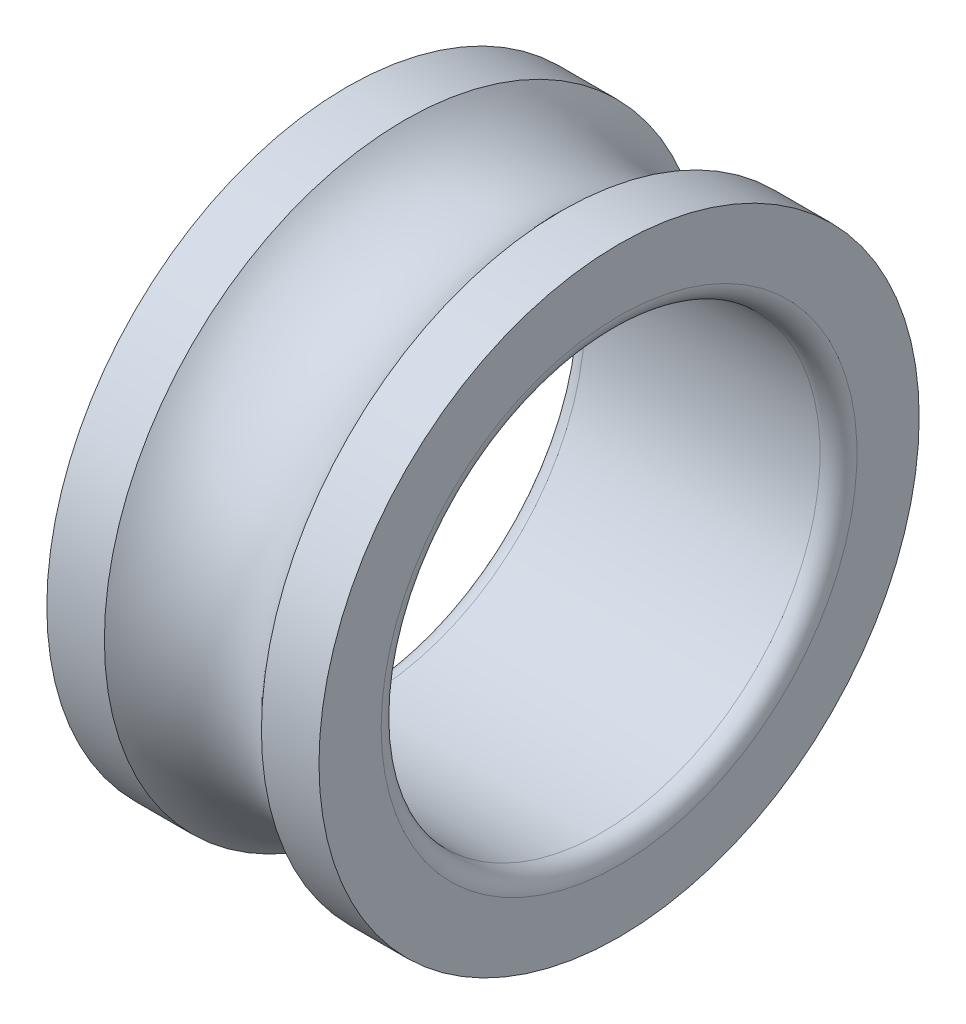
ISO-10303-21;
HEADER;
FILE_DESCRIPTION(('STEP AP214'),'2;1');
FILE_NAME('part.step','',(''),(''),'','','');
FILE_SCHEMA(('AUTOMOTIVE_DESIGN { 1 0 10303 214 1 1 1 1 }'));
ENDSEC;
DATA;
#1=APPLICATION_CONTEXT('core data for automotive mechanical design processes');
#2=APPLICATION_PROTOCOL_DEFINITION('international standard','automotive_design',2000,#1);
#3=PRODUCT_CONTEXT('',#1,'mechanical');
#4=PRODUCT('Part','Part','',(#3));
#5=PRODUCT_RELATED_PRODUCT_CATEGORY('part','',(#4));
#6=PRODUCT_DEFINITION_FORMATION('','',#4);
#7=PRODUCT_DEFINITION_CONTEXT('part definition',#1,'design');
#8=PRODUCT_DEFINITION('design','',#6,#7);
#9=PRODUCT_DEFINITION_SHAPE('','',#8);
#10=(LENGTH_UNIT() NAMED_UNIT(*) SI_UNIT(.MILLI.,.METRE.));
#11=(NAMED_UNIT(*) PLANE_ANGLE_UNIT() SI_UNIT($,.RADIAN.));
#12=(NAMED_UNIT(*) SI_UNIT($,.STERADIAN.) SOLID_ANGLE_UNIT());
#13=UNCERTAINTY_MEASURE_WITH_UNIT(LENGTH_MEASURE(1.E-05),#10,'distance_accuracy_value','');
#14=(GEOMETRIC_REPRESENTATION_CONTEXT(3) GLOBAL_UNCERTAINTY_ASSIGNED_CONTEXT((#13)) GLOBAL_UNIT_ASSIGNED_CONTEXT((#10,
#11,#12)) REPRESENTATION_CONTEXT('',''));
#15=CARTESIAN_POINT('',(0.,0.,0.));
#16=DIRECTION('',(0.,0.,1.));
#17=DIRECTION('',(1.,0.,0.));
#18=AXIS2_PLACEMENT_3D('',#15,#16,#17);
#19=CARTESIAN_POINT('',(-15.5,34.1851851851852,0.));
#20=DIRECTION('',(1.,0.,0.));
#21=DIRECTION('',(0.,0.,-1.));
#22=AXIS2_PLACEMENT_3D('',#19,#20,#21);
#23=PLANE('',#22);
#24=CARTESIAN_POINT('',(-15.5,0.,0.));
#25=DIRECTION('',(-1.,0.,0.));
#26=DIRECTION('',(0.,0.,1.));
#27=AXIS2_PLACEMENT_3D('',#24,#25,#26);
#28=CIRCLE('',#27,27.1);
#29=CARTESIAN_POINT('',(-15.5,0.,27.1));
#30=VERTEX_POINT('',#29);
#31=EDGE_CURVE('E10',#30,#30,#28,.T.);
#32=ORIENTED_EDGE('',*,*,#31,.F.);
#33=EDGE_LOOP('',(#32));
#34=FACE_BOUND('',#33,.T.);
#35=CARTESIAN_POINT('',(-15.5,0.,0.));
#36=DIRECTION('',(-1.,0.,0.));
#37=DIRECTION('',(0.,0.,1.));
#38=AXIS2_PLACEMENT_3D('',#35,#36,#37);
#39=CIRCLE('',#38,34.1851851851852);
#40=CARTESIAN_POINT('',(-15.5,0.,34.1851851851852));
#41=VERTEX_POINT('',#40);
#42=EDGE_CURVE('E59',#41,#41,#39,.T.);
#43=ORIENTED_EDGE('',*,*,#42,.T.);
#44=EDGE_LOOP('',(#43));
#45=FACE_BOUND('',#44,.T.);
#46=ADVANCED_FACE('F31',(#34,#45),#23,.F.);
#47=CARTESIAN_POINT('',(-13.4,0.,0.));
#48=DIRECTION('',(-1.,0.,0.));
#49=DIRECTION('',(0.,0.,1.));
#50=AXIS2_PLACEMENT_3D('',#47,#48,#49);
#51=TOROIDAL_SURFACE('',#50,27.1,2.1);
#52=CARTESIAN_POINT('',(-13.4,0.,0.));
#53=DIRECTION('',(-1.,0.,0.));
#54=DIRECTION('',(0.,0.,1.));
#55=AXIS2_PLACEMENT_3D('',#52,#53,#54);
#56=CIRCLE('',#55,25.);
#57=CARTESIAN_POINT('',(-13.4,0.,25.));
#58=VERTEX_POINT('',#57);
#59=EDGE_CURVE('E37',#58,#58,#56,.T.);
#60=ORIENTED_EDGE('',*,*,#59,.F.);
#61=EDGE_LOOP('',(#60));
#62=FACE_BOUND('',#61,.T.);
#63=ORIENTED_EDGE('',*,*,#31,.T.);
#64=EDGE_LOOP('',(#63));
#65=FACE_BOUND('',#64,.T.);
#66=ADVANCED_FACE('F96',(#62,#65),#51,.T.);
#67=CARTESIAN_POINT('',(-14.2800925925926,0.,0.));
#68=DIRECTION('',(-1.,0.,0.));
#69=DIRECTION('',(0.,0.,1.));
#70=AXIS2_PLACEMENT_3D('',#67,#68,#69);
#71=CYLINDRICAL_SURFACE('',#70,25.);
#72=CARTESIAN_POINT('',(13.4,0.,0.));
#73=DIRECTION('',(-1.,0.,0.));
#74=DIRECTION('',(0.,0.,1.));
#75=AXIS2_PLACEMENT_3D('',#72,#73,#74);
#76=CIRCLE('',#75,25.);
#77=CARTESIAN_POINT('',(13.4,0.,25.));
#78=VERTEX_POINT('',#77);
#79=EDGE_CURVE('E41',#78,#78,#76,.T.);
#80=ORIENTED_EDGE('',*,*,#79,.F.);
#81=EDGE_LOOP('',(#80));
#82=FACE_BOUND('',#81,.T.);
#83=ORIENTED_EDGE('',*,*,#59,.T.);
#84=EDGE_LOOP('',(#83));
#85=FACE_BOUND('',#84,.T.);
#86=ADVANCED_FACE('F91',(#82,#85),#71,.F.);
#87=CARTESIAN_POINT('',(13.4,0.,0.));
#88=DIRECTION('',(-1.,0.,0.));
#89=DIRECTION('',(0.,0.,1.));
#90=AXIS2_PLACEMENT_3D('',#87,#88,#89);
#91=TOROIDAL_SURFACE('',#90,27.1,2.1);
#92=CARTESIAN_POINT('',(15.5,0.,0.));
#93=DIRECTION('',(-1.,0.,0.));
#94=DIRECTION('',(0.,0.,1.));
#95=AXIS2_PLACEMENT_3D('',#92,#93,#94);
#96=CIRCLE('',#95,27.1);
#97=CARTESIAN_POINT('',(15.5,0.,27.1));
#98=VERTEX_POINT('',#97);
#99=EDGE_CURVE('E45',#98,#98,#96,.T.);
#100=ORIENTED_EDGE('',*,*,#99,.F.);
#101=EDGE_LOOP('',(#100));
#102=FACE_BOUND('',#101,.T.);
#103=ORIENTED_EDGE('',*,*,#79,.T.);
#104=EDGE_LOOP('',(#103));
#105=FACE_BOUND('',#104,.T.);
#106=ADVANCED_FACE('F85',(#102,#105),#91,.T.);
#107=CARTESIAN_POINT('',(15.5,34.1851851851852,0.));
#108=DIRECTION('',(-1.,0.,0.));
#109=DIRECTION('',(0.,0.,1.));
#110=AXIS2_PLACEMENT_3D('',#107,#108,#109);
#111=PLANE('',#110);
#112=CARTESIAN_POINT('',(15.5,0.,0.));
#113=DIRECTION('',(-1.,0.,0.));
#114=DIRECTION('',(0.,0.,1.));
#115=AXIS2_PLACEMENT_3D('',#112,#113,#114);
#116=CIRCLE('',#115,34.1851851851852);
#117=CARTESIAN_POINT('',(15.5,0.,34.1851851851852));
#118=VERTEX_POINT('',#117);
#119=EDGE_CURVE('E50',#118,#118,#116,.T.);
#120=ORIENTED_EDGE('',*,*,#119,.F.);
#121=EDGE_LOOP('',(#120));
#122=FACE_BOUND('',#121,.T.);
#123=ORIENTED_EDGE('',*,*,#99,.T.);
#124=EDGE_LOOP('',(#123));
#125=FACE_BOUND('',#124,.T.);
#126=ADVANCED_FACE('F79',(#122,#125),#111,.F.);
#127=CARTESIAN_POINT('',(-14.2800925925926,0.,0.));
#128=DIRECTION('',(-1.,0.,0.));
#129=DIRECTION('',(0.,0.,1.));
#130=AXIS2_PLACEMENT_3D('',#127,#128,#129);
#131=CYLINDRICAL_SURFACE('',#130,34.1851851851852);
#132=CARTESIAN_POINT('',(8.94427190999915,0.,0.));
#133=DIRECTION('',(-1.,0.,0.));
#134=DIRECTION('',(0.,0.,1.));
#135=AXIS2_PLACEMENT_3D('',#132,#133,#134);
#136=CIRCLE('',#135,34.1851851851852);
#137=CARTESIAN_POINT('',(8.94427190999915,0.,34.1851851851852));
#138=VERTEX_POINT('',#137);
#139=EDGE_CURVE('E53',#138,#138,#136,.T.);
#140=ORIENTED_EDGE('',*,*,#139,.F.);
#141=EDGE_LOOP('',(#140));
#142=FACE_BOUND('',#141,.T.);
#143=ORIENTED_EDGE('',*,*,#119,.T.);
#144=EDGE_LOOP('',(#143));
#145=FACE_BOUND('',#144,.T.);
#146=ADVANCED_FACE('F73',(#142,#145),#131,.T.);
#147=CARTESIAN_POINT('',(0.,0.,0.));
#148=DIRECTION('',(-1.,0.,0.));
#149=DIRECTION('',(0.,0.,1.));
#150=AXIS2_PLACEMENT_3D('',#147,#148,#149);
#151=TOROIDAL_SURFACE('',#150,42.1851851851852,12.);
#152=CARTESIAN_POINT('',(-8.94427190999917,0.,0.));
#153=DIRECTION('',(-1.,0.,0.));
#154=DIRECTION('',(0.,0.,1.));
#155=AXIS2_PLACEMENT_3D('',#152,#153,#154);
#156=CIRCLE('',#155,34.1851851851852);
#157=CARTESIAN_POINT('',(-8.94427190999917,0.,34.1851851851852));
#158=VERTEX_POINT('',#157);
#159=EDGE_CURVE('E56',#158,#158,#156,.T.);
#160=ORIENTED_EDGE('',*,*,#159,.F.);
#161=EDGE_LOOP('',(#160));
#162=FACE_BOUND('',#161,.T.);
#163=ORIENTED_EDGE('',*,*,#139,.T.);
#164=EDGE_LOOP('',(#163));
#165=FACE_BOUND('',#164,.T.);
#166=ADVANCED_FACE('F67',(#162,#165),#151,.F.);
#167=CARTESIAN_POINT('',(-14.2800925925926,0.,0.));
#168=DIRECTION('',(-1.,0.,0.));
#169=DIRECTION('',(0.,0.,1.));
#170=AXIS2_PLACEMENT_3D('',#167,#168,#169);
#171=CYLINDRICAL_SURFACE('',#170,34.1851851851852);
#172=ORIENTED_EDGE('',*,*,#42,.F.);
#173=EDGE_LOOP('',(#172));
#174=FACE_BOUND('',#173,.T.);
#175=ORIENTED_EDGE('',*,*,#159,.T.);
#176=EDGE_LOOP('',(#175));
#177=FACE_BOUND('',#176,.T.);
#178=ADVANCED_FACE('F64',(#174,#177),#171,.T.);
#179=CLOSED_SHELL('',(#46,#66,#86,#106,#126,#146,#166,#178));
#180=MANIFOLD_SOLID_BREP('B2',#179);
#181=ADVANCED_BREP_SHAPE_REPRESENTATION('',(#18,#180),#14);
#182=SHAPE_DEFINITION_REPRESENTATION(#9,#181);
ENDSEC;
END-ISO-10303-21;
